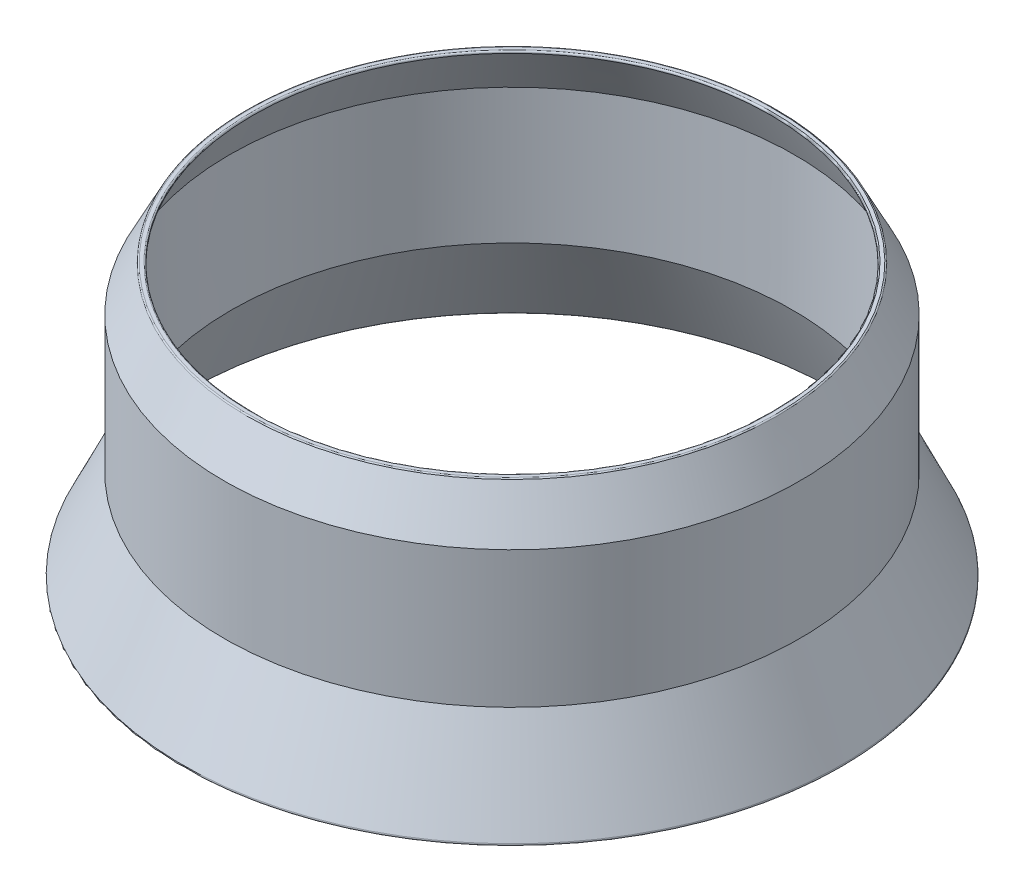
ISO-10303-21;
HEADER;
FILE_DESCRIPTION(('STEP AP214'),'2;1');
FILE_NAME('part.step','',(''),(''),'','','');
FILE_SCHEMA(('AUTOMOTIVE_DESIGN { 1 0 10303 214 1 1 1 1 }'));
ENDSEC;
DATA;
#1=APPLICATION_CONTEXT('core data for automotive mechanical design processes');
#2=APPLICATION_PROTOCOL_DEFINITION('international standard','automotive_design',2000,#1);
#3=PRODUCT_CONTEXT('',#1,'mechanical');
#4=PRODUCT('Part','Part','',(#3));
#5=PRODUCT_RELATED_PRODUCT_CATEGORY('part','',(#4));
#6=PRODUCT_DEFINITION_FORMATION('','',#4);
#7=PRODUCT_DEFINITION_CONTEXT('part definition',#1,'design');
#8=PRODUCT_DEFINITION('design','',#6,#7);
#9=PRODUCT_DEFINITION_SHAPE('','',#8);
#10=(LENGTH_UNIT() NAMED_UNIT(*) SI_UNIT(.MILLI.,.METRE.));
#11=(NAMED_UNIT(*) PLANE_ANGLE_UNIT() SI_UNIT($,.RADIAN.));
#12=(NAMED_UNIT(*) SI_UNIT($,.STERADIAN.) SOLID_ANGLE_UNIT());
#13=UNCERTAINTY_MEASURE_WITH_UNIT(LENGTH_MEASURE(1.E-05),#10,'distance_accuracy_value','');
#14=(GEOMETRIC_REPRESENTATION_CONTEXT(3) GLOBAL_UNCERTAINTY_ASSIGNED_CONTEXT((#13)) GLOBAL_UNIT_ASSIGNED_CONTEXT((#10,
#11,#12)) REPRESENTATION_CONTEXT('',''));
#15=CARTESIAN_POINT('',(0.,0.,0.));
#16=DIRECTION('',(0.,0.,1.));
#17=DIRECTION('',(1.,0.,0.));
#18=AXIS2_PLACEMENT_3D('',#15,#16,#17);
#19=CARTESIAN_POINT('',(-17.4496374616753,-0.18269182435416,0.));
#20=DIRECTION('',(0.,-1.,0.));
#21=DIRECTION('',(1.,0.,0.));
#22=AXIS2_PLACEMENT_3D('',#19,#20,#21);
#23=CONICAL_SURFACE('',#22,17.0937952251236,0.474315434428903);
#24=CARTESIAN_POINT('',(-17.4496374616753,-0.145672956088541,0.));
#25=DIRECTION('',(0.,1.,0.));
#26=DIRECTION('',(-1.,0.,0.));
#27=AXIS2_PLACEMENT_3D('',#24,#25,#26);
#28=CIRCLE('',#27,17.074789486388);
#29=CARTESIAN_POINT('',(-34.5244269480634,-0.145672956088543,0.));
#30=VERTEX_POINT('',#29);
#31=EDGE_CURVE('E60',#30,#30,#28,.T.);
#32=ORIENTED_EDGE('',*,*,#31,.T.);
#33=EDGE_LOOP('',(#32));
#34=FACE_BOUND('',#33,.T.);
#35=CARTESIAN_POINT('',(-17.4496374616753,-3.18269182435416,0.));
#36=DIRECTION('',(0.,1.,0.));
#37=DIRECTION('',(-1.,0.,0.));
#38=AXIS2_PLACEMENT_3D('',#35,#36,#37);
#39=CIRCLE('',#38,18.6340156283381);
#40=CARTESIAN_POINT('',(-36.0836530900134,-3.18269182435416,0.));
#41=VERTEX_POINT('',#40);
#42=EDGE_CURVE('E63',#41,#41,#39,.T.);
#43=ORIENTED_EDGE('',*,*,#42,.F.);
#44=EDGE_LOOP('',(#43));
#45=FACE_BOUND('',#44,.T.);
#46=ADVANCED_FACE('F31',(#34,#45),#23,.F.);
#47=CARTESIAN_POINT('',(-17.4496374616753,-3.18269182435416,0.));
#48=DIRECTION('',(0.,1.,0.));
#49=DIRECTION('',(-1.,0.,0.));
#50=AXIS2_PLACEMENT_3D('',#47,#48,#49);
#51=CONICAL_SURFACE('',#50,18.6340156283381,0.012591426453714);
#52=CARTESIAN_POINT('',(-17.4496374616753,-12.,0.));
#53=DIRECTION('',(0.,1.,0.));
#54=DIRECTION('',(-1.,0.,0.));
#55=AXIS2_PLACEMENT_3D('',#52,#53,#54);
#56=CIRCLE('',#55,18.5229872732354);
#57=CARTESIAN_POINT('',(-35.9726247349107,-12.,0.));
#58=VERTEX_POINT('',#57);
#59=EDGE_CURVE('E66',#58,#58,#56,.T.);
#60=ORIENTED_EDGE('',*,*,#59,.F.);
#61=EDGE_LOOP('',(#60));
#62=FACE_BOUND('',#61,.T.);
#63=ORIENTED_EDGE('',*,*,#42,.T.);
#64=EDGE_LOOP('',(#63));
#65=FACE_BOUND('',#64,.T.);
#66=ADVANCED_FACE('F95',(#62,#65),#51,.F.);
#67=CARTESIAN_POINT('',(-17.4496374616753,-12.,0.));
#68=DIRECTION('',(0.,-1.,0.));
#69=DIRECTION('',(1.,0.,0.));
#70=AXIS2_PLACEMENT_3D('',#67,#68,#69);
#71=CONICAL_SURFACE('',#70,18.5229872732354,0.436332312998587);
#72=CARTESIAN_POINT('',(-17.4496374616753,-17.9422618261741,0.));
#73=DIRECTION('',(0.,1.,0.));
#74=DIRECTION('',(-1.,0.,0.));
#75=AXIS2_PLACEMENT_3D('',#72,#73,#74);
#76=CIRCLE('',#75,21.2939094695425);
#77=CARTESIAN_POINT('',(-38.7435469312178,-17.9422618261741,0.));
#78=VERTEX_POINT('',#77);
#79=EDGE_CURVE('E38',#78,#78,#76,.F.);
#80=ORIENTED_EDGE('',*,*,#79,.T.);
#81=EDGE_LOOP('',(#80));
#82=FACE_BOUND('',#81,.T.);
#83=ORIENTED_EDGE('',*,*,#59,.T.);
#84=EDGE_LOOP('',(#83));
#85=FACE_BOUND('',#84,.T.);
#86=ADVANCED_FACE('F91',(#82,#85),#71,.F.);
#87=CARTESIAN_POINT('',(3.87119576049012,-18.,0.));
#88=DIRECTION('',(0.,1.,0.));
#89=DIRECTION('',(-1.,0.,0.));
#90=AXIS2_PLACEMENT_3D('',#87,#88,#89);
#91=PLANE('',#90);
#92=CARTESIAN_POINT('',(-17.4496374616753,-18.,0.));
#93=DIRECTION('',(0.,1.,0.));
#94=DIRECTION('',(-1.,0.,0.));
#95=AXIS2_PLACEMENT_3D('',#92,#93,#94);
#96=CIRCLE('',#95,21.3845402482462);
#97=CARTESIAN_POINT('',(-38.8341777099215,-18.,0.));
#98=VERTEX_POINT('',#97);
#99=EDGE_CURVE('E42',#98,#98,#96,.T.);
#100=ORIENTED_EDGE('',*,*,#99,.T.);
#101=EDGE_LOOP('',(#100));
#102=FACE_BOUND('',#101,.T.);
#103=CARTESIAN_POINT('',(-17.4496374616753,-18.,0.));
#104=DIRECTION('',(0.,1.,0.));
#105=DIRECTION('',(-1.,0.,0.));
#106=AXIS2_PLACEMENT_3D('',#103,#104,#105);
#107=CIRCLE('',#106,21.6307352561081);
#108=CARTESIAN_POINT('',(-39.0803727177834,-18.,0.));
#109=VERTEX_POINT('',#108);
#110=EDGE_CURVE('E46',#109,#109,#107,.F.);
#111=ORIENTED_EDGE('',*,*,#110,.T.);
#112=EDGE_LOOP('',(#111));
#113=FACE_BOUND('',#112,.T.);
#114=ADVANCED_FACE('F86',(#102,#113),#91,.F.);
#115=CARTESIAN_POINT('',(-17.4496374616753,-18.,0.));
#116=DIRECTION('',(0.,-1.,0.));
#117=DIRECTION('',(1.,0.,0.));
#118=AXIS2_PLACEMENT_3D('',#115,#116,#117);
#119=CONICAL_SURFACE('',#118,21.7877038138198,0.436332312998587);
#120=CARTESIAN_POINT('',(-17.4496374616753,-17.8577381738259,0.));
#121=DIRECTION('',(0.,1.,0.));
#122=DIRECTION('',(-1.,0.,0.));
#123=AXIS2_PLACEMENT_3D('',#120,#121,#122);
#124=CIRCLE('',#123,21.7213660348117);
#125=CARTESIAN_POINT('',(-39.1710034964871,-17.8577381738259,0.));
#126=VERTEX_POINT('',#125);
#127=EDGE_CURVE('E10',#126,#126,#124,.T.);
#128=ORIENTED_EDGE('',*,*,#127,.T.);
#129=EDGE_LOOP('',(#128));
#130=FACE_BOUND('',#129,.T.);
#131=CARTESIAN_POINT('',(-17.4496374616753,-12.,0.));
#132=DIRECTION('',(0.,1.,0.));
#133=DIRECTION('',(-1.,0.,0.));
#134=AXIS2_PLACEMENT_3D('',#131,#132,#133);
#135=CIRCLE('',#134,18.9898578648898);
#136=CARTESIAN_POINT('',(-36.4394953265651,-12.,0.));
#137=VERTEX_POINT('',#136);
#138=EDGE_CURVE('E69',#137,#137,#135,.T.);
#139=ORIENTED_EDGE('',*,*,#138,.F.);
#140=EDGE_LOOP('',(#139));
#141=FACE_BOUND('',#140,.T.);
#142=ADVANCED_FACE('F81',(#130,#141),#119,.T.);
#143=CARTESIAN_POINT('',(-17.4496374616753,4.84281940761424,0.));
#144=DIRECTION('',(0.,1.,0.));
#145=DIRECTION('',(-1.,0.,0.));
#146=AXIS2_PLACEMENT_3D('',#143,#144,#145);
#147=CYLINDRICAL_SURFACE('',#146,18.9898578648898);
#148=CARTESIAN_POINT('',(-17.4496374616753,-3.,0.));
#149=DIRECTION('',(0.,1.,0.));
#150=DIRECTION('',(-1.,0.,0.));
#151=AXIS2_PLACEMENT_3D('',#148,#149,#150);
#152=CIRCLE('',#151,18.9898578648898);
#153=CARTESIAN_POINT('',(-36.4394953265651,-3.,0.));
#154=VERTEX_POINT('',#153);
#155=EDGE_CURVE('E72',#154,#154,#152,.T.);
#156=ORIENTED_EDGE('',*,*,#155,.F.);
#157=EDGE_LOOP('',(#156));
#158=FACE_BOUND('',#157,.T.);
#159=ORIENTED_EDGE('',*,*,#138,.T.);
#160=EDGE_LOOP('',(#159));
#161=FACE_BOUND('',#160,.T.);
#162=ADVANCED_FACE('F78',(#158,#161),#147,.T.);
#163=CARTESIAN_POINT('',(-17.4496374616753,-3.,0.));
#164=DIRECTION('',(0.,-1.,0.));
#165=DIRECTION('',(1.,0.,0.));
#166=AXIS2_PLACEMENT_3D('',#163,#164,#165);
#167=CONICAL_SURFACE('',#166,18.9898578648898,0.474315434428902);
#168=CARTESIAN_POINT('',(-17.4496374616753,-0.0543270439114646,0.));
#169=DIRECTION('',(0.,1.,0.));
#170=DIRECTION('',(-1.,0.,0.));
#171=AXIS2_PLACEMENT_3D('',#168,#169,#170);
#172=CIRCLE('',#171,17.4775293355016);
#173=CARTESIAN_POINT('',(-34.9271667971769,-0.0543270439114666,0.));
#174=VERTEX_POINT('',#173);
#175=EDGE_CURVE('E51',#174,#174,#172,.F.);
#176=ORIENTED_EDGE('',*,*,#175,.T.);
#177=EDGE_LOOP('',(#176));
#178=FACE_BOUND('',#177,.T.);
#179=ORIENTED_EDGE('',*,*,#155,.T.);
#180=EDGE_LOOP('',(#179));
#181=FACE_BOUND('',#180,.T.);
#182=ADVANCED_FACE('F76',(#178,#181),#167,.T.);
#183=CARTESIAN_POINT('',(0.,0.,0.));
#184=DIRECTION('',(0.,-1.,0.));
#185=DIRECTION('',(1.,0.,0.));
#186=AXIS2_PLACEMENT_3D('',#183,#184,#185);
#187=PLANE('',#186);
#188=CARTESIAN_POINT('',(-17.4496374616753,0.,0.));
#189=DIRECTION('',(0.,-1.,0.));
#190=DIRECTION('',(1.,0.,0.));
#191=AXIS2_PLACEMENT_3D('',#188,#189,#190);
#192=CIRCLE('',#191,17.163750045526);
#193=CARTESIAN_POINT('',(-0.285887416149353,0.,0.));
#194=VERTEX_POINT('',#193);
#195=EDGE_CURVE('E54',#194,#194,#192,.T.);
#196=ORIENTED_EDGE('',*,*,#195,.T.);
#197=EDGE_LOOP('',(#196));
#198=FACE_BOUND('',#197,.T.);
#199=CARTESIAN_POINT('',(-17.4496374616753,0.,0.));
#200=DIRECTION('',(0.,-1.,0.));
#201=DIRECTION('',(1.,0.,0.));
#202=AXIS2_PLACEMENT_3D('',#199,#200,#201);
#203=CIRCLE('',#202,17.3885687763636);
#204=CARTESIAN_POINT('',(-0.0610686853116868,0.,0.));
#205=VERTEX_POINT('',#204);
#206=EDGE_CURVE('E57',#205,#205,#203,.F.);
#207=ORIENTED_EDGE('',*,*,#206,.T.);
#208=EDGE_LOOP('',(#207));
#209=FACE_BOUND('',#208,.T.);
#210=ADVANCED_FACE('F110',(#198,#209),#187,.F.);
#211=CARTESIAN_POINT('',(-17.4496374616753,-0.100000000000002,0.));
#212=DIRECTION('',(0.,-1.,0.));
#213=DIRECTION('',(1.,0.,0.));
#214=AXIS2_PLACEMENT_3D('',#211,#212,#213);
#215=TOROIDAL_SURFACE('',#214,17.163750045526,0.1);
#216=ORIENTED_EDGE('',*,*,#195,.F.);
#217=EDGE_LOOP('',(#216));
#218=FACE_BOUND('',#217,.T.);
#219=ORIENTED_EDGE('',*,*,#31,.F.);
#220=EDGE_LOOP('',(#219));
#221=FACE_BOUND('',#220,.T.);
#222=ADVANCED_FACE('F106',(#218,#221),#215,.T.);
#223=CARTESIAN_POINT('',(-17.4496374616753,-0.100000000000002,0.));
#224=DIRECTION('',(0.,-1.,0.));
#225=DIRECTION('',(1.,0.,0.));
#226=AXIS2_PLACEMENT_3D('',#223,#224,#225);
#227=TOROIDAL_SURFACE('',#226,17.3885687763636,0.1);
#228=ORIENTED_EDGE('',*,*,#175,.F.);
#229=EDGE_LOOP('',(#228));
#230=FACE_BOUND('',#229,.T.);
#231=ORIENTED_EDGE('',*,*,#206,.F.);
#232=EDGE_LOOP('',(#231));
#233=FACE_BOUND('',#232,.T.);
#234=ADVANCED_FACE('F109',(#230,#233),#227,.T.);
#235=CARTESIAN_POINT('',(-17.4496374616753,-17.9,0.));
#236=DIRECTION('',(0.,1.,0.));
#237=DIRECTION('',(-1.,0.,0.));
#238=AXIS2_PLACEMENT_3D('',#235,#236,#237);
#239=TOROIDAL_SURFACE('',#238,21.3845402482462,0.1);
#240=ORIENTED_EDGE('',*,*,#79,.F.);
#241=EDGE_LOOP('',(#240));
#242=FACE_BOUND('',#241,.T.);
#243=ORIENTED_EDGE('',*,*,#99,.F.);
#244=EDGE_LOOP('',(#243));
#245=FACE_BOUND('',#244,.T.);
#246=ADVANCED_FACE('F113',(#242,#245),#239,.T.);
#247=CARTESIAN_POINT('',(-17.4496374616753,-17.9,0.));
#248=DIRECTION('',(0.,1.,0.));
#249=DIRECTION('',(-1.,0.,0.));
#250=AXIS2_PLACEMENT_3D('',#247,#248,#249);
#251=TOROIDAL_SURFACE('',#250,21.6307352561081,0.1);
#252=ORIENTED_EDGE('',*,*,#110,.F.);
#253=EDGE_LOOP('',(#252));
#254=FACE_BOUND('',#253,.T.);
#255=ORIENTED_EDGE('',*,*,#127,.F.);
#256=EDGE_LOOP('',(#255));
#257=FACE_BOUND('',#256,.T.);
#258=ADVANCED_FACE('F33',(#254,#257),#251,.T.);
#259=CLOSED_SHELL('',(#46,#66,#86,#114,#142,#162,#182,#210,#222,#234,#246,#258));
#260=MANIFOLD_SOLID_BREP('B2',#259);
#261=ADVANCED_BREP_SHAPE_REPRESENTATION('',(#18,#260),#14);
#262=SHAPE_DEFINITION_REPRESENTATION(#9,#261);
ENDSEC;
END-ISO-10303-21;
